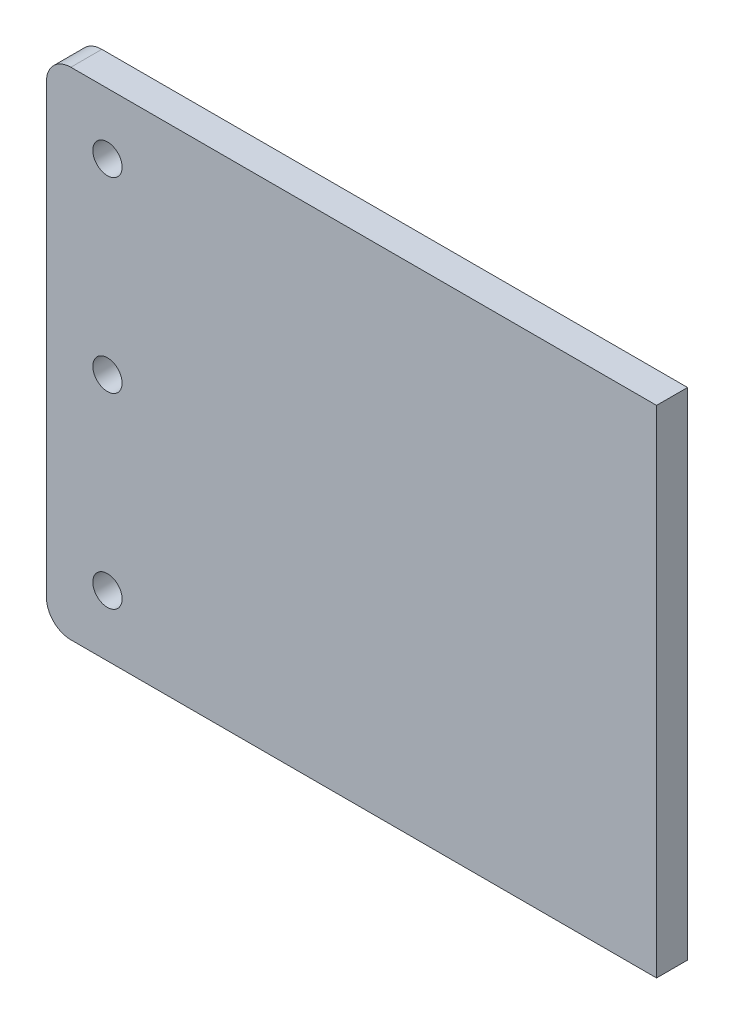
ISO-10303-21;
HEADER;
FILE_DESCRIPTION(('STEP AP214'),'2;1');
FILE_NAME('part.step','',(''),(''),'','','');
FILE_SCHEMA(('AUTOMOTIVE_DESIGN { 1 0 10303 214 1 1 1 1 }'));
ENDSEC;
DATA;
#1=APPLICATION_CONTEXT('core data for automotive mechanical design processes');
#2=APPLICATION_PROTOCOL_DEFINITION('international standard','automotive_design',2000,#1);
#3=PRODUCT_CONTEXT('',#1,'mechanical');
#4=PRODUCT('Part','Part','',(#3));
#5=PRODUCT_RELATED_PRODUCT_CATEGORY('part','',(#4));
#6=PRODUCT_DEFINITION_FORMATION('','',#4);
#7=PRODUCT_DEFINITION_CONTEXT('part definition',#1,'design');
#8=PRODUCT_DEFINITION('design','',#6,#7);
#9=PRODUCT_DEFINITION_SHAPE('','',#8);
#10=(LENGTH_UNIT() NAMED_UNIT(*) SI_UNIT(.MILLI.,.METRE.));
#11=(NAMED_UNIT(*) PLANE_ANGLE_UNIT() SI_UNIT($,.RADIAN.));
#12=(NAMED_UNIT(*) SI_UNIT($,.STERADIAN.) SOLID_ANGLE_UNIT());
#13=UNCERTAINTY_MEASURE_WITH_UNIT(LENGTH_MEASURE(1.E-05),#10,'distance_accuracy_value','');
#14=(GEOMETRIC_REPRESENTATION_CONTEXT(3) GLOBAL_UNCERTAINTY_ASSIGNED_CONTEXT((#13)) GLOBAL_UNIT_ASSIGNED_CONTEXT((#10,
#11,#12)) REPRESENTATION_CONTEXT('',''));
#15=CARTESIAN_POINT('',(0.,0.,0.));
#16=DIRECTION('',(0.,0.,1.));
#17=DIRECTION('',(1.,0.,0.));
#18=AXIS2_PLACEMENT_3D('',#15,#16,#17);
#19=CARTESIAN_POINT('',(50.,0.,0.));
#20=DIRECTION('',(1.,0.,0.));
#21=DIRECTION('',(0.,0.,1.));
#22=AXIS2_PLACEMENT_3D('',#19,#20,#21);
#23=PLANE('',#22);
#24=DIRECTION('',(0.,0.,1.));
#25=VECTOR('',#24,1.);
#26=CARTESIAN_POINT('',(50.,102.,0.));
#27=LINE('',#26,#25);
#28=CARTESIAN_POINT('',(50.,102.,-44.4542024237734));
#29=VERTEX_POINT('',#28);
#30=CARTESIAN_POINT('',(50.,102.,-38.1042024237733));
#31=VERTEX_POINT('',#30);
#32=EDGE_CURVE('E38',#29,#31,#27,.T.);
#33=ORIENTED_EDGE('',*,*,#32,.F.);
#34=DIRECTION('',(0.,1.,0.));
#35=VECTOR('',#34,1.);
#36=CARTESIAN_POINT('',(50.,203.6,-44.4542024237733));
#37=LINE('',#36,#35);
#38=CARTESIAN_POINT('',(50.,203.6,-44.4542024237733));
#39=VERTEX_POINT('',#38);
#40=EDGE_CURVE('E90',#29,#39,#37,.T.);
#41=ORIENTED_EDGE('',*,*,#40,.T.);
#42=DIRECTION('',(0.,0.,1.));
#43=VECTOR('',#42,1.);
#44=CARTESIAN_POINT('',(50.,203.6,-21.9542024237733));
#45=LINE('',#44,#43);
#46=CARTESIAN_POINT('',(50.,203.6,-38.1042024237733));
#47=VERTEX_POINT('',#46);
#48=EDGE_CURVE('E120',#39,#47,#45,.T.);
#49=ORIENTED_EDGE('',*,*,#48,.T.);
#50=DIRECTION('',(0.,1.,0.));
#51=VECTOR('',#50,1.);
#52=CARTESIAN_POINT('',(50.,0.,-38.1042024237733));
#53=LINE('',#52,#51);
#54=EDGE_CURVE('E11',#31,#47,#53,.T.);
#55=ORIENTED_EDGE('',*,*,#54,.F.);
#56=EDGE_LOOP('',(#33,#41,#49,#55));
#57=FACE_BOUND('',#56,.T.);
#58=ADVANCED_FACE('F34',(#57),#23,.T.);
#59=CARTESIAN_POINT('',(-75.,0.,0.));
#60=DIRECTION('',(1.,0.,0.));
#61=DIRECTION('',(0.,0.,1.));
#62=AXIS2_PLACEMENT_3D('',#59,#60,#61);
#63=PLANE('',#62);
#64=DIRECTION('',(0.,-1.,0.));
#65=VECTOR('',#64,1.);
#66=CARTESIAN_POINT('',(-75.,203.6,-38.1042024237733));
#67=LINE('',#66,#65);
#68=CARTESIAN_POINT('',(-75.,198.6,-38.1042024237733));
#69=VERTEX_POINT('',#68);
#70=CARTESIAN_POINT('',(-75.,107.,-38.1042024237733));
#71=VERTEX_POINT('',#70);
#72=EDGE_CURVE('E127',#69,#71,#67,.T.);
#73=ORIENTED_EDGE('',*,*,#72,.F.);
#74=DIRECTION('',(0.,0.,1.));
#75=VECTOR('',#74,1.);
#76=CARTESIAN_POINT('',(-75.,198.6,2.44989214100618E-13));
#77=LINE('',#76,#75);
#78=CARTESIAN_POINT('',(-75.,198.6,-44.4542024237733));
#79=VERTEX_POINT('',#78);
#80=EDGE_CURVE('E102',#79,#69,#77,.T.);
#81=ORIENTED_EDGE('',*,*,#80,.F.);
#82=DIRECTION('',(0.,1.,0.));
#83=VECTOR('',#82,1.);
#84=CARTESIAN_POINT('',(-75.,203.6,-44.4542024237733));
#85=LINE('',#84,#83);
#86=CARTESIAN_POINT('',(-75.,107.,-44.4542024237733));
#87=VERTEX_POINT('',#86);
#88=EDGE_CURVE('E129',#87,#79,#85,.T.);
#89=ORIENTED_EDGE('',*,*,#88,.F.);
#90=DIRECTION('',(0.,0.,-1.));
#91=VECTOR('',#90,1.);
#92=CARTESIAN_POINT('',(-75.,107.,0.));
#93=LINE('',#92,#91);
#94=EDGE_CURVE('E115',#71,#87,#93,.T.);
#95=ORIENTED_EDGE('',*,*,#94,.F.);
#96=EDGE_LOOP('',(#73,#81,#89,#95));
#97=FACE_BOUND('',#96,.T.);
#98=ADVANCED_FACE('F163',(#97),#63,.F.);
#99=CARTESIAN_POINT('',(-50.,203.6,-44.4542024237733));
#100=DIRECTION('',(0.,0.,1.));
#101=DIRECTION('',(0.,-1.,0.));
#102=AXIS2_PLACEMENT_3D('',#99,#100,#101);
#103=PLANE('',#102);
#104=CARTESIAN_POINT('',(-62.5,114.5,-44.4542024237734));
#105=DIRECTION('',(0.,0.,-1.));
#106=DIRECTION('',(0.,-1.,0.));
#107=AXIS2_PLACEMENT_3D('',#104,#105,#106);
#108=CIRCLE('',#107,3.00000000000001);
#109=CARTESIAN_POINT('',(-62.5,111.5,-44.4542024237734));
#110=VERTEX_POINT('',#109);
#111=EDGE_CURVE('E132',#110,#110,#108,.T.);
#112=ORIENTED_EDGE('',*,*,#111,.F.);
#113=EDGE_LOOP('',(#112));
#114=FACE_BOUND('',#113,.T.);
#115=CARTESIAN_POINT('',(-62.5,191.1,-44.4542024237733));
#116=DIRECTION('',(0.,0.,-1.));
#117=DIRECTION('',(0.,-1.,0.));
#118=AXIS2_PLACEMENT_3D('',#115,#116,#117);
#119=CIRCLE('',#118,3.00000000000001);
#120=CARTESIAN_POINT('',(-62.5,188.1,-44.4542024237733));
#121=VERTEX_POINT('',#120);
#122=EDGE_CURVE('E138',#121,#121,#119,.T.);
#123=ORIENTED_EDGE('',*,*,#122,.F.);
#124=EDGE_LOOP('',(#123));
#125=FACE_BOUND('',#124,.T.);
#126=CARTESIAN_POINT('',(-62.5,152.8,-44.4542024237733));
#127=DIRECTION('',(0.,0.,-1.));
#128=DIRECTION('',(0.,-1.,0.));
#129=AXIS2_PLACEMENT_3D('',#126,#127,#128);
#130=CIRCLE('',#129,3.00000000000001);
#131=CARTESIAN_POINT('',(-62.5,149.8,-44.4542024237733));
#132=VERTEX_POINT('',#131);
#133=EDGE_CURVE('E144',#132,#132,#130,.T.);
#134=ORIENTED_EDGE('',*,*,#133,.F.);
#135=EDGE_LOOP('',(#134));
#136=FACE_BOUND('',#135,.T.);
#137=ORIENTED_EDGE('',*,*,#88,.T.);
#138=CARTESIAN_POINT('',(-70.,198.6,-44.4542024237733));
#139=DIRECTION('',(0.,0.,-1.));
#140=DIRECTION('',(0.,-1.,0.));
#141=AXIS2_PLACEMENT_3D('',#138,#139,#140);
#142=CIRCLE('',#141,5.);
#143=CARTESIAN_POINT('',(-70.,203.6,-44.4542024237733));
#144=VERTEX_POINT('',#143);
#145=EDGE_CURVE('E113',#144,#79,#142,.F.);
#146=ORIENTED_EDGE('',*,*,#145,.F.);
#147=DIRECTION('',(1.,0.,0.));
#148=VECTOR('',#147,1.);
#149=CARTESIAN_POINT('',(-50.,203.6,-44.4542024237733));
#150=LINE('',#149,#148);
#151=EDGE_CURVE('E95',#144,#39,#150,.T.);
#152=ORIENTED_EDGE('',*,*,#151,.T.);
#153=ORIENTED_EDGE('',*,*,#40,.F.);
#154=DIRECTION('',(1.,0.,0.));
#155=VECTOR('',#154,1.);
#156=CARTESIAN_POINT('',(-75.,102.,-44.4542024237733));
#157=LINE('',#156,#155);
#158=CARTESIAN_POINT('',(-70.,102.,-44.4542024237733));
#159=VERTEX_POINT('',#158);
#160=EDGE_CURVE('E125',#159,#29,#157,.T.);
#161=ORIENTED_EDGE('',*,*,#160,.F.);
#162=CARTESIAN_POINT('',(-70.,107.,-44.4542024237734));
#163=DIRECTION('',(0.,0.,-1.));
#164=DIRECTION('',(0.,-1.,0.));
#165=AXIS2_PLACEMENT_3D('',#162,#163,#164);
#166=CIRCLE('',#165,5.);
#167=EDGE_CURVE('E107',#87,#159,#166,.F.);
#168=ORIENTED_EDGE('',*,*,#167,.F.);
#169=EDGE_LOOP('',(#137,#146,#152,#153,#161,#168));
#170=FACE_BOUND('',#169,.T.);
#171=ADVANCED_FACE('F159',(#114,#125,#136,#170),#103,.F.);
#172=CARTESIAN_POINT('',(-62.5,114.5,-143.154202423773));
#173=DIRECTION('',(0.,0.,1.));
#174=DIRECTION('',(-1.,0.,0.));
#175=AXIS2_PLACEMENT_3D('',#172,#173,#174);
#176=CYLINDRICAL_SURFACE('',#175,3.00000000000001);
#177=CARTESIAN_POINT('',(-62.5,114.5,-38.1042024237733));
#178=DIRECTION('',(0.,0.,1.));
#179=DIRECTION('',(0.,1.,0.));
#180=AXIS2_PLACEMENT_3D('',#177,#178,#179);
#181=CIRCLE('',#180,3.00000000000001);
#182=CARTESIAN_POINT('',(-62.5,117.5,-38.1042024237733));
#183=VERTEX_POINT('',#182);
#184=EDGE_CURVE('E135',#183,#183,#181,.T.);
#185=ORIENTED_EDGE('',*,*,#184,.T.);
#186=EDGE_LOOP('',(#185));
#187=FACE_BOUND('',#186,.T.);
#188=ORIENTED_EDGE('',*,*,#111,.T.);
#189=EDGE_LOOP('',(#188));
#190=FACE_BOUND('',#189,.T.);
#191=ADVANCED_FACE('F188',(#187,#190),#176,.F.);
#192=CARTESIAN_POINT('',(-62.5,191.1,-143.154202423773));
#193=DIRECTION('',(0.,0.,1.));
#194=DIRECTION('',(-1.,0.,0.));
#195=AXIS2_PLACEMENT_3D('',#192,#193,#194);
#196=CYLINDRICAL_SURFACE('',#195,3.00000000000001);
#197=CARTESIAN_POINT('',(-62.5,191.1,-38.1042024237733));
#198=DIRECTION('',(0.,0.,1.));
#199=DIRECTION('',(0.,1.,0.));
#200=AXIS2_PLACEMENT_3D('',#197,#198,#199);
#201=CIRCLE('',#200,3.00000000000001);
#202=CARTESIAN_POINT('',(-62.5,194.1,-38.1042024237733));
#203=VERTEX_POINT('',#202);
#204=EDGE_CURVE('E141',#203,#203,#201,.T.);
#205=ORIENTED_EDGE('',*,*,#204,.T.);
#206=EDGE_LOOP('',(#205));
#207=FACE_BOUND('',#206,.T.);
#208=ORIENTED_EDGE('',*,*,#122,.T.);
#209=EDGE_LOOP('',(#208));
#210=FACE_BOUND('',#209,.T.);
#211=ADVANCED_FACE('F36',(#207,#210),#196,.F.);
#212=CARTESIAN_POINT('',(-62.5,152.8,-143.154202423773));
#213=DIRECTION('',(0.,0.,1.));
#214=DIRECTION('',(-1.,0.,0.));
#215=AXIS2_PLACEMENT_3D('',#212,#213,#214);
#216=CYLINDRICAL_SURFACE('',#215,3.00000000000001);
#217=CARTESIAN_POINT('',(-62.5,152.8,-38.1042024237733));
#218=DIRECTION('',(0.,0.,1.));
#219=DIRECTION('',(0.,1.,0.));
#220=AXIS2_PLACEMENT_3D('',#217,#218,#219);
#221=CIRCLE('',#220,3.00000000000001);
#222=CARTESIAN_POINT('',(-62.5,155.8,-38.1042024237733));
#223=VERTEX_POINT('',#222);
#224=EDGE_CURVE('E147',#223,#223,#221,.T.);
#225=ORIENTED_EDGE('',*,*,#224,.T.);
#226=EDGE_LOOP('',(#225));
#227=FACE_BOUND('',#226,.T.);
#228=ORIENTED_EDGE('',*,*,#133,.T.);
#229=EDGE_LOOP('',(#228));
#230=FACE_BOUND('',#229,.T.);
#231=ADVANCED_FACE('F174',(#227,#230),#216,.F.);
#232=CARTESIAN_POINT('',(-70.,198.6,2.44989214100618E-13));
#233=DIRECTION('',(0.,0.,1.));
#234=DIRECTION('',(0.,-1.,0.));
#235=AXIS2_PLACEMENT_3D('',#232,#233,#234);
#236=CYLINDRICAL_SURFACE('',#235,5.);
#237=ORIENTED_EDGE('',*,*,#145,.T.);
#238=ORIENTED_EDGE('',*,*,#80,.T.);
#239=CARTESIAN_POINT('',(-70.,198.6,-38.1042024237733));
#240=DIRECTION('',(0.,0.,1.));
#241=DIRECTION('',(0.,1.,0.));
#242=AXIS2_PLACEMENT_3D('',#239,#240,#241);
#243=CIRCLE('',#242,5.);
#244=CARTESIAN_POINT('',(-70.,203.6,-38.1042024237733));
#245=VERTEX_POINT('',#244);
#246=EDGE_CURVE('E87',#69,#245,#243,.F.);
#247=ORIENTED_EDGE('',*,*,#246,.T.);
#248=DIRECTION('',(0.,0.,1.));
#249=VECTOR('',#248,1.);
#250=CARTESIAN_POINT('',(-70.,203.6,-21.9542024237733));
#251=LINE('',#250,#249);
#252=EDGE_CURVE('E93',#245,#144,#251,.F.);
#253=ORIENTED_EDGE('',*,*,#252,.T.);
#254=EDGE_LOOP('',(#237,#238,#247,#253));
#255=FACE_BOUND('',#254,.T.);
#256=ADVANCED_FACE('F100',(#255),#236,.T.);
#257=CARTESIAN_POINT('',(-70.,107.,0.));
#258=DIRECTION('',(0.,0.,-1.));
#259=DIRECTION('',(1.,0.,0.));
#260=AXIS2_PLACEMENT_3D('',#257,#258,#259);
#261=CYLINDRICAL_SURFACE('',#260,5.);
#262=CARTESIAN_POINT('',(-70.,107.,-38.1042024237733));
#263=DIRECTION('',(0.,0.,1.));
#264=DIRECTION('',(0.,1.,0.));
#265=AXIS2_PLACEMENT_3D('',#262,#263,#264);
#266=CIRCLE('',#265,5.);
#267=CARTESIAN_POINT('',(-70.,102.,-38.1042024237733));
#268=VERTEX_POINT('',#267);
#269=EDGE_CURVE('E98',#268,#71,#266,.F.);
#270=ORIENTED_EDGE('',*,*,#269,.T.);
#271=ORIENTED_EDGE('',*,*,#94,.T.);
#272=ORIENTED_EDGE('',*,*,#167,.T.);
#273=DIRECTION('',(0.,0.,-1.));
#274=VECTOR('',#273,1.);
#275=CARTESIAN_POINT('',(-70.,102.,-44.4542024237733));
#276=LINE('',#275,#274);
#277=EDGE_CURVE('E104',#159,#268,#276,.F.);
#278=ORIENTED_EDGE('',*,*,#277,.T.);
#279=EDGE_LOOP('',(#270,#271,#272,#278));
#280=FACE_BOUND('',#279,.T.);
#281=ADVANCED_FACE('F165',(#280),#261,.T.);
#282=CARTESIAN_POINT('',(-75.,203.6,-38.1042024237733));
#283=DIRECTION('',(0.,0.,-1.));
#284=DIRECTION('',(0.,1.,0.));
#285=AXIS2_PLACEMENT_3D('',#282,#283,#284);
#286=PLANE('',#285);
#287=ORIENTED_EDGE('',*,*,#184,.F.);
#288=EDGE_LOOP('',(#287));
#289=FACE_BOUND('',#288,.T.);
#290=ORIENTED_EDGE('',*,*,#204,.F.);
#291=EDGE_LOOP('',(#290));
#292=FACE_BOUND('',#291,.T.);
#293=ORIENTED_EDGE('',*,*,#224,.F.);
#294=EDGE_LOOP('',(#293));
#295=FACE_BOUND('',#294,.T.);
#296=DIRECTION('',(1.,0.,0.));
#297=VECTOR('',#296,1.);
#298=CARTESIAN_POINT('',(-75.,102.,-38.1042024237733));
#299=LINE('',#298,#297);
#300=EDGE_CURVE('E48',#268,#31,#299,.T.);
#301=ORIENTED_EDGE('',*,*,#300,.T.);
#302=ORIENTED_EDGE('',*,*,#54,.T.);
#303=DIRECTION('',(1.,0.,0.));
#304=VECTOR('',#303,1.);
#305=CARTESIAN_POINT('',(-75.,203.6,-38.1042024237733));
#306=LINE('',#305,#304);
#307=EDGE_CURVE('E56',#245,#47,#306,.T.);
#308=ORIENTED_EDGE('',*,*,#307,.F.);
#309=ORIENTED_EDGE('',*,*,#246,.F.);
#310=ORIENTED_EDGE('',*,*,#72,.T.);
#311=ORIENTED_EDGE('',*,*,#269,.F.);
#312=EDGE_LOOP('',(#301,#302,#308,#309,#310,#311));
#313=FACE_BOUND('',#312,.T.);
#314=ADVANCED_FACE('F84',(#289,#292,#295,#313),#286,.F.);
#315=CARTESIAN_POINT('',(-50.,203.6,-21.9542024237733));
#316=DIRECTION('',(0.,-1.,0.));
#317=DIRECTION('',(0.,0.,-1.));
#318=AXIS2_PLACEMENT_3D('',#315,#316,#317);
#319=PLANE('',#318);
#320=ORIENTED_EDGE('',*,*,#48,.F.);
#321=ORIENTED_EDGE('',*,*,#151,.F.);
#322=ORIENTED_EDGE('',*,*,#252,.F.);
#323=ORIENTED_EDGE('',*,*,#307,.T.);
#324=EDGE_LOOP('',(#320,#321,#322,#323));
#325=FACE_BOUND('',#324,.T.);
#326=ADVANCED_FACE('F94',(#325),#319,.F.);
#327=CARTESIAN_POINT('',(-75.,102.,-44.4542024237733));
#328=DIRECTION('',(0.,1.,0.));
#329=DIRECTION('',(0.,0.,1.));
#330=AXIS2_PLACEMENT_3D('',#327,#328,#329);
#331=PLANE('',#330);
#332=ORIENTED_EDGE('',*,*,#160,.T.);
#333=ORIENTED_EDGE('',*,*,#32,.T.);
#334=ORIENTED_EDGE('',*,*,#300,.F.);
#335=ORIENTED_EDGE('',*,*,#277,.F.);
#336=EDGE_LOOP('',(#332,#333,#334,#335));
#337=FACE_BOUND('',#336,.T.);
#338=ADVANCED_FACE('F154',(#337),#331,.F.);
#339=CLOSED_SHELL('',(#58,#98,#171,#191,#211,#231,#256,#281,#314,#326,#338));
#340=MANIFOLD_SOLID_BREP('B2',#339);
#341=ADVANCED_BREP_SHAPE_REPRESENTATION('',(#18,#340),#14);
#342=SHAPE_DEFINITION_REPRESENTATION(#9,#341);
ENDSEC;
END-ISO-10303-21;
